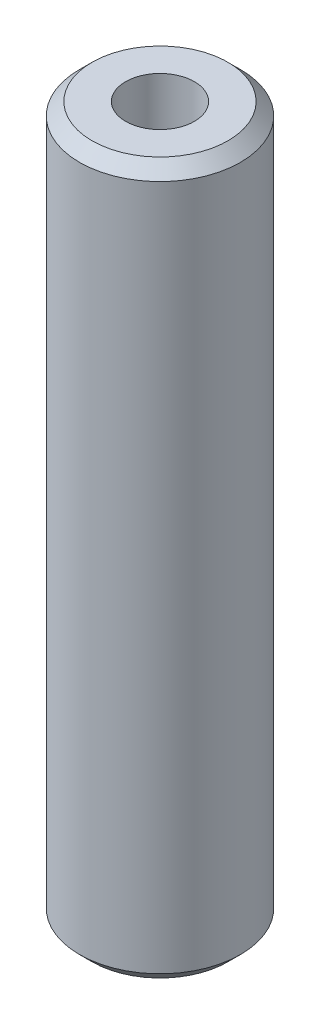
ISO-10303-21;
HEADER;
FILE_DESCRIPTION(('STEP AP214'),'2;1');
FILE_NAME('part.step','',(''),(''),'','','');
FILE_SCHEMA(('AUTOMOTIVE_DESIGN { 1 0 10303 214 1 1 1 1 }'));
ENDSEC;
DATA;
#1=APPLICATION_CONTEXT('core data for automotive mechanical design processes');
#2=APPLICATION_PROTOCOL_DEFINITION('international standard','automotive_design',2000,#1);
#3=PRODUCT_CONTEXT('',#1,'mechanical');
#4=PRODUCT('Part','Part','',(#3));
#5=PRODUCT_RELATED_PRODUCT_CATEGORY('part','',(#4));
#6=PRODUCT_DEFINITION_FORMATION('','',#4);
#7=PRODUCT_DEFINITION_CONTEXT('part definition',#1,'design');
#8=PRODUCT_DEFINITION('design','',#6,#7);
#9=PRODUCT_DEFINITION_SHAPE('','',#8);
#10=(LENGTH_UNIT() NAMED_UNIT(*) SI_UNIT(.MILLI.,.METRE.));
#11=(NAMED_UNIT(*) PLANE_ANGLE_UNIT() SI_UNIT($,.RADIAN.));
#12=(NAMED_UNIT(*) SI_UNIT($,.STERADIAN.) SOLID_ANGLE_UNIT());
#13=UNCERTAINTY_MEASURE_WITH_UNIT(LENGTH_MEASURE(1.E-05),#10,'distance_accuracy_value','');
#14=(GEOMETRIC_REPRESENTATION_CONTEXT(3) GLOBAL_UNCERTAINTY_ASSIGNED_CONTEXT((#13)) GLOBAL_UNIT_ASSIGNED_CONTEXT((#10,
#11,#12)) REPRESENTATION_CONTEXT('',''));
#15=CARTESIAN_POINT('',(0.,0.,0.));
#16=DIRECTION('',(0.,0.,1.));
#17=DIRECTION('',(1.,0.,0.));
#18=AXIS2_PLACEMENT_3D('',#15,#16,#17);
#19=CARTESIAN_POINT('',(0.,331.331739577562,0.));
#20=DIRECTION('',(0.,-1.,0.));
#21=DIRECTION('',(0.,0.,-1.));
#22=AXIS2_PLACEMENT_3D('',#19,#20,#21);
#23=CYLINDRICAL_SURFACE('',#22,37.5);
#24=CARTESIAN_POINT('',(0.,325.519175677713,0.));
#25=DIRECTION('',(0.,1.,0.));
#26=DIRECTION('',(0.,0.,1.));
#27=AXIS2_PLACEMENT_3D('',#24,#25,#26);
#28=CIRCLE('',#27,37.5);
#29=CARTESIAN_POINT('',(0.,325.519175677713,37.5));
#30=VERTEX_POINT('',#29);
#31=EDGE_CURVE('E50',#30,#30,#28,.F.);
#32=ORIENTED_EDGE('',*,*,#31,.T.);
#33=EDGE_LOOP('',(#32));
#34=FACE_BOUND('',#33,.T.);
#35=CARTESIAN_POINT('',(0.,5.81256389984913,0.));
#36=DIRECTION('',(0.,1.,0.));
#37=DIRECTION('',(0.,0.,1.));
#38=AXIS2_PLACEMENT_3D('',#35,#36,#37);
#39=CIRCLE('',#38,37.5);
#40=CARTESIAN_POINT('',(0.,5.81256389984913,37.5));
#41=VERTEX_POINT('',#40);
#42=EDGE_CURVE('E51',#41,#41,#39,.T.);
#43=ORIENTED_EDGE('',*,*,#42,.T.);
#44=EDGE_LOOP('',(#43));
#45=FACE_BOUND('',#44,.T.);
#46=ADVANCED_FACE('F39',(#34,#45),#23,.T.);
#47=CARTESIAN_POINT('',(0.,331.331739577562,0.));
#48=DIRECTION('',(0.,1.,0.));
#49=DIRECTION('',(0.,0.,1.));
#50=AXIS2_PLACEMENT_3D('',#47,#48,#49);
#51=PLANE('',#50);
#52=CARTESIAN_POINT('',(0.,331.331739577562,0.));
#53=DIRECTION('',(0.,1.,0.));
#54=DIRECTION('',(0.,0.,1.));
#55=AXIS2_PLACEMENT_3D('',#52,#53,#54);
#56=CIRCLE('',#55,31.6874361001508);
#57=CARTESIAN_POINT('',(0.,331.331739577562,31.6874361001508));
#58=VERTEX_POINT('',#57);
#59=EDGE_CURVE('E54',#58,#58,#56,.T.);
#60=ORIENTED_EDGE('',*,*,#59,.T.);
#61=EDGE_LOOP('',(#60));
#62=FACE_BOUND('',#61,.T.);
#63=CARTESIAN_POINT('',(0.,331.331739577562,0.));
#64=DIRECTION('',(0.,1.,0.));
#65=DIRECTION('',(0.,0.,1.));
#66=AXIS2_PLACEMENT_3D('',#63,#64,#65);
#67=CIRCLE('',#66,16.0361573140034);
#68=CARTESIAN_POINT('',(0.,331.331739577562,16.0361573140034));
#69=VERTEX_POINT('',#68);
#70=EDGE_CURVE('E58',#69,#69,#67,.T.);
#71=ORIENTED_EDGE('',*,*,#70,.F.);
#72=EDGE_LOOP('',(#71));
#73=FACE_BOUND('',#72,.T.);
#74=ADVANCED_FACE('F69',(#62,#73),#51,.T.);
#75=CARTESIAN_POINT('',(0.,0.,0.));
#76=DIRECTION('',(0.,1.,0.));
#77=DIRECTION('',(0.,0.,1.));
#78=AXIS2_PLACEMENT_3D('',#75,#76,#77);
#79=PLANE('',#78);
#80=CARTESIAN_POINT('',(0.,0.,0.));
#81=DIRECTION('',(0.,1.,0.));
#82=DIRECTION('',(0.,0.,1.));
#83=AXIS2_PLACEMENT_3D('',#80,#81,#82);
#84=CIRCLE('',#83,31.6874361001508);
#85=CARTESIAN_POINT('',(0.,0.,31.6874361001508));
#86=VERTEX_POINT('',#85);
#87=EDGE_CURVE('E10',#86,#86,#84,.F.);
#88=ORIENTED_EDGE('',*,*,#87,.T.);
#89=EDGE_LOOP('',(#88));
#90=FACE_BOUND('',#89,.T.);
#91=CARTESIAN_POINT('',(0.,0.,0.));
#92=DIRECTION('',(0.,1.,0.));
#93=DIRECTION('',(0.,0.,1.));
#94=AXIS2_PLACEMENT_3D('',#91,#92,#93);
#95=CIRCLE('',#94,16.0361573140034);
#96=CARTESIAN_POINT('',(0.,0.,16.0361573140034));
#97=VERTEX_POINT('',#96);
#98=EDGE_CURVE('E63',#97,#97,#95,.T.);
#99=ORIENTED_EDGE('',*,*,#98,.T.);
#100=EDGE_LOOP('',(#99));
#101=FACE_BOUND('',#100,.T.);
#102=ADVANCED_FACE('F75',(#90,#101),#79,.F.);
#103=CARTESIAN_POINT('',(0.,331.331739577562,0.));
#104=DIRECTION('',(0.,-1.,0.));
#105=DIRECTION('',(0.,0.,-1.));
#106=AXIS2_PLACEMENT_3D('',#103,#104,#105);
#107=CYLINDRICAL_SURFACE('',#106,16.0361573140034);
#108=ORIENTED_EDGE('',*,*,#70,.T.);
#109=EDGE_LOOP('',(#108));
#110=FACE_BOUND('',#109,.T.);
#111=ORIENTED_EDGE('',*,*,#98,.F.);
#112=EDGE_LOOP('',(#111));
#113=FACE_BOUND('',#112,.T.);
#114=ADVANCED_FACE('F70',(#110,#113),#107,.F.);
#115=CARTESIAN_POINT('',(0.,331.331739577562,0.));
#116=DIRECTION('',(0.,-1.,0.));
#117=DIRECTION('',(0.,0.,-1.));
#118=AXIS2_PLACEMENT_3D('',#115,#116,#117);
#119=CONICAL_SURFACE('',#118,31.6874361001508,0.785398163397441);
#120=ORIENTED_EDGE('',*,*,#31,.F.);
#121=EDGE_LOOP('',(#120));
#122=FACE_BOUND('',#121,.T.);
#123=ORIENTED_EDGE('',*,*,#59,.F.);
#124=EDGE_LOOP('',(#123));
#125=FACE_BOUND('',#124,.T.);
#126=ADVANCED_FACE('F81',(#122,#125),#119,.T.);
#127=CARTESIAN_POINT('',(0.,5.81256389984913,0.));
#128=DIRECTION('',(0.,1.,0.));
#129=DIRECTION('',(0.,0.,1.));
#130=AXIS2_PLACEMENT_3D('',#127,#128,#129);
#131=CONICAL_SURFACE('',#130,37.5,0.785398163397453);
#132=ORIENTED_EDGE('',*,*,#87,.F.);
#133=EDGE_LOOP('',(#132));
#134=FACE_BOUND('',#133,.T.);
#135=ORIENTED_EDGE('',*,*,#42,.F.);
#136=EDGE_LOOP('',(#135));
#137=FACE_BOUND('',#136,.T.);
#138=ADVANCED_FACE('F45',(#134,#137),#131,.T.);
#139=CLOSED_SHELL('',(#46,#74,#102,#114,#126,#138));
#140=MANIFOLD_SOLID_BREP('B2',#139);
#141=ADVANCED_BREP_SHAPE_REPRESENTATION('',(#18,#140),#14);
#142=SHAPE_DEFINITION_REPRESENTATION(#9,#141);
ENDSEC;
END-ISO-10303-21;
